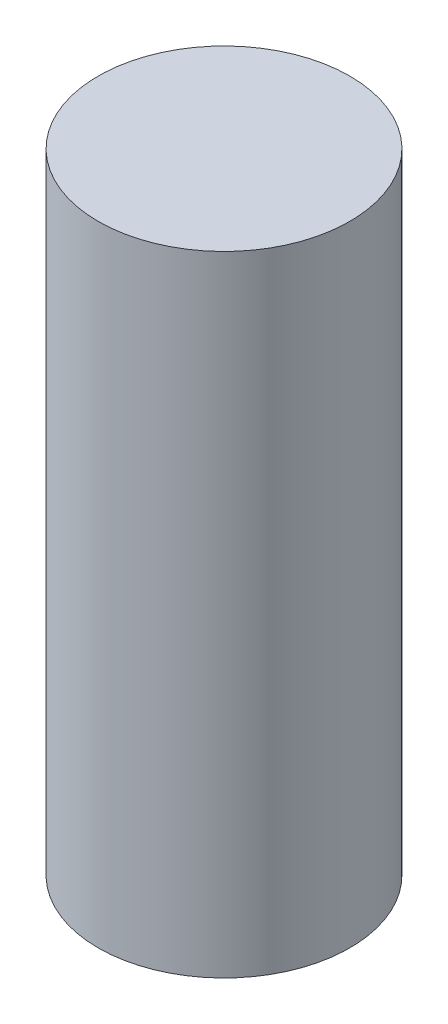
ISO-10303-21;
HEADER;
FILE_DESCRIPTION(('STEP AP214'),'2;1');
FILE_NAME('part.step','',(''),(''),'','','');
FILE_SCHEMA(('AUTOMOTIVE_DESIGN { 1 0 10303 214 1 1 1 1 }'));
ENDSEC;
DATA;
#1=APPLICATION_CONTEXT('core data for automotive mechanical design processes');
#2=APPLICATION_PROTOCOL_DEFINITION('international standard','automotive_design',2000,#1);
#3=PRODUCT_CONTEXT('',#1,'mechanical');
#4=PRODUCT('Part','Part','',(#3));
#5=PRODUCT_RELATED_PRODUCT_CATEGORY('part','',(#4));
#6=PRODUCT_DEFINITION_FORMATION('','',#4);
#7=PRODUCT_DEFINITION_CONTEXT('part definition',#1,'design');
#8=PRODUCT_DEFINITION('design','',#6,#7);
#9=PRODUCT_DEFINITION_SHAPE('','',#8);
#10=(LENGTH_UNIT() NAMED_UNIT(*) SI_UNIT(.MILLI.,.METRE.));
#11=(NAMED_UNIT(*) PLANE_ANGLE_UNIT() SI_UNIT($,.RADIAN.));
#12=(NAMED_UNIT(*) SI_UNIT($,.STERADIAN.) SOLID_ANGLE_UNIT());
#13=UNCERTAINTY_MEASURE_WITH_UNIT(LENGTH_MEASURE(1.E-05),#10,'distance_accuracy_value','');
#14=(GEOMETRIC_REPRESENTATION_CONTEXT(3) GLOBAL_UNCERTAINTY_ASSIGNED_CONTEXT((#13)) GLOBAL_UNIT_ASSIGNED_CONTEXT((#10,
#11,#12)) REPRESENTATION_CONTEXT('',''));
#15=CARTESIAN_POINT('',(0.,0.,0.));
#16=DIRECTION('',(0.,0.,1.));
#17=DIRECTION('',(1.,0.,0.));
#18=AXIS2_PLACEMENT_3D('',#15,#16,#17);
#19=CARTESIAN_POINT('',(0.,12.5,0.));
#20=DIRECTION('',(0.,-1.,0.));
#21=DIRECTION('',(0.,0.,-1.));
#22=AXIS2_PLACEMENT_3D('',#19,#20,#21);
#23=CYLINDRICAL_SURFACE('',#22,2.5);
#24=CARTESIAN_POINT('',(0.,12.5,0.));
#25=DIRECTION('',(0.,1.,0.));
#26=DIRECTION('',(0.,0.,1.));
#27=AXIS2_PLACEMENT_3D('',#24,#25,#26);
#28=CIRCLE('',#27,2.5);
#29=CARTESIAN_POINT('',(0.,12.5,2.5));
#30=VERTEX_POINT('',#29);
#31=EDGE_CURVE('E10',#30,#30,#28,.T.);
#32=ORIENTED_EDGE('',*,*,#31,.F.);
#33=EDGE_LOOP('',(#32));
#34=FACE_BOUND('',#33,.T.);
#35=CARTESIAN_POINT('',(0.,0.,0.));
#36=DIRECTION('',(0.,1.,0.));
#37=DIRECTION('',(0.,0.,1.));
#38=AXIS2_PLACEMENT_3D('',#35,#36,#37);
#39=CIRCLE('',#38,2.5);
#40=CARTESIAN_POINT('',(0.,0.,2.5));
#41=VERTEX_POINT('',#40);
#42=EDGE_CURVE('E34',#41,#41,#39,.T.);
#43=ORIENTED_EDGE('',*,*,#42,.T.);
#44=EDGE_LOOP('',(#43));
#45=FACE_BOUND('',#44,.T.);
#46=ADVANCED_FACE('F31',(#34,#45),#23,.T.);
#47=CARTESIAN_POINT('',(0.,12.5,0.));
#48=DIRECTION('',(0.,1.,0.));
#49=DIRECTION('',(0.,0.,1.));
#50=AXIS2_PLACEMENT_3D('',#47,#48,#49);
#51=PLANE('',#50);
#52=ORIENTED_EDGE('',*,*,#31,.T.);
#53=EDGE_LOOP('',(#52));
#54=FACE_BOUND('',#53,.T.);
#55=ADVANCED_FACE('F46',(#54),#51,.T.);
#56=CARTESIAN_POINT('',(0.,0.,0.));
#57=DIRECTION('',(0.,1.,0.));
#58=DIRECTION('',(0.,0.,1.));
#59=AXIS2_PLACEMENT_3D('',#56,#57,#58);
#60=PLANE('',#59);
#61=ORIENTED_EDGE('',*,*,#42,.F.);
#62=EDGE_LOOP('',(#61));
#63=FACE_BOUND('',#62,.T.);
#64=ADVANCED_FACE('F44',(#63),#60,.F.);
#65=CLOSED_SHELL('',(#46,#55,#64));
#66=MANIFOLD_SOLID_BREP('B2',#65);
#67=ADVANCED_BREP_SHAPE_REPRESENTATION('',(#18,#66),#14);
#68=SHAPE_DEFINITION_REPRESENTATION(#9,#67);
ENDSEC;
END-ISO-10303-21;
